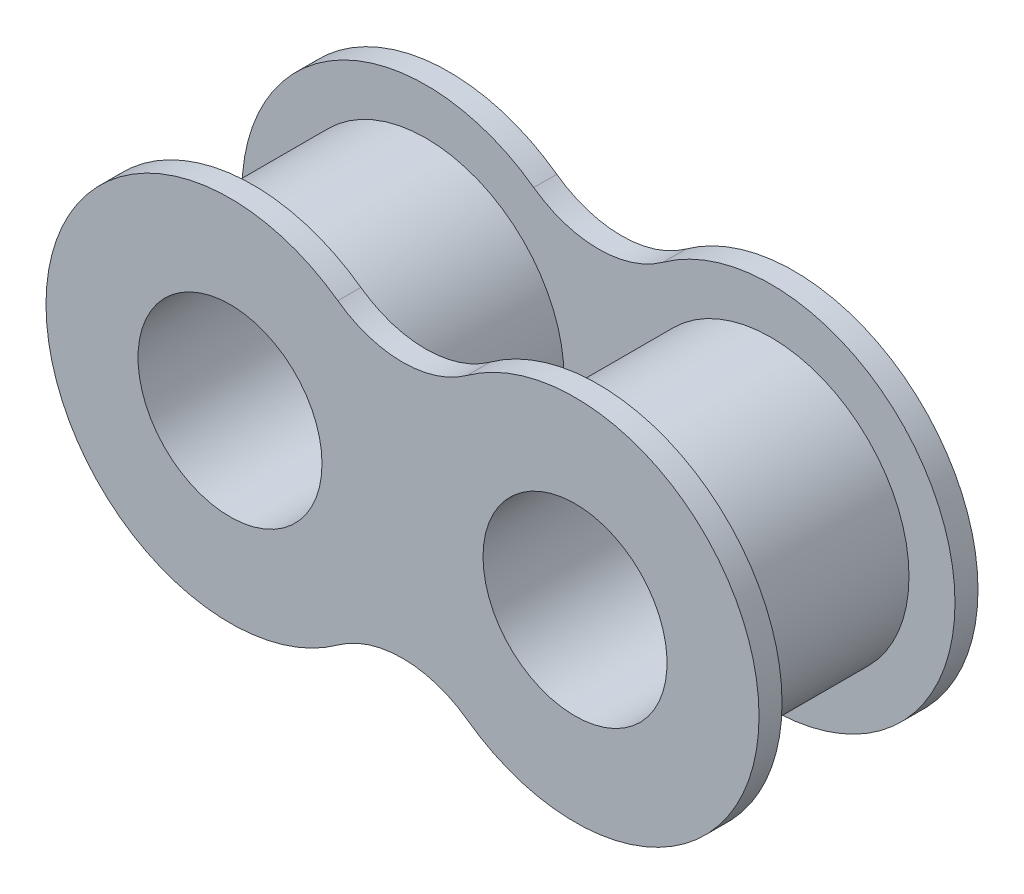
ISO-10303-21;
HEADER;
FILE_DESCRIPTION(('STEP AP214'),'2;1');
FILE_NAME('part.step','',(''),(''),'','','');
FILE_SCHEMA(('AUTOMOTIVE_DESIGN { 1 0 10303 214 1 1 1 1 }'));
ENDSEC;
DATA;
#1=APPLICATION_CONTEXT('core data for automotive mechanical design processes');
#2=APPLICATION_PROTOCOL_DEFINITION('international standard','automotive_design',2000,#1);
#3=PRODUCT_CONTEXT('',#1,'mechanical');
#4=PRODUCT('Part','Part','',(#3));
#5=PRODUCT_RELATED_PRODUCT_CATEGORY('part','',(#4));
#6=PRODUCT_DEFINITION_FORMATION('','',#4);
#7=PRODUCT_DEFINITION_CONTEXT('part definition',#1,'design');
#8=PRODUCT_DEFINITION('design','',#6,#7);
#9=PRODUCT_DEFINITION_SHAPE('','',#8);
#10=(LENGTH_UNIT() NAMED_UNIT(*) SI_UNIT(.MILLI.,.METRE.));
#11=(NAMED_UNIT(*) PLANE_ANGLE_UNIT() SI_UNIT($,.RADIAN.));
#12=(NAMED_UNIT(*) SI_UNIT($,.STERADIAN.) SOLID_ANGLE_UNIT());
#13=UNCERTAINTY_MEASURE_WITH_UNIT(LENGTH_MEASURE(1.E-05),#10,'distance_accuracy_value','');
#14=(GEOMETRIC_REPRESENTATION_CONTEXT(3) GLOBAL_UNCERTAINTY_ASSIGNED_CONTEXT((#13)) GLOBAL_UNIT_ASSIGNED_CONTEXT((#10,
#11,#12)) REPRESENTATION_CONTEXT('',''));
#15=CARTESIAN_POINT('',(0.,0.,0.));
#16=DIRECTION('',(0.,0.,1.));
#17=DIRECTION('',(1.,0.,0.));
#18=AXIS2_PLACEMENT_3D('',#15,#16,#17);
#19=CARTESIAN_POINT('',(2.38125,3.29328778540534,0.635));
#20=DIRECTION('',(0.,0.,1.));
#21=DIRECTION('',(1.,0.,0.));
#22=AXIS2_PLACEMENT_3D('',#19,#20,#21);
#23=PLANE('',#22);
#24=CARTESIAN_POINT('',(4.7625,0.,0.635));
#25=DIRECTION('',(0.,0.,1.));
#26=DIRECTION('',(1.,0.,0.));
#27=AXIS2_PLACEMENT_3D('',#24,#25,#26);
#28=CIRCLE('',#27,3.81);
#29=CARTESIAN_POINT('',(8.5725,0.,0.635));
#30=VERTEX_POINT('',#29);
#31=EDGE_CURVE('E11',#30,#30,#28,.T.);
#32=ORIENTED_EDGE('',*,*,#31,.F.);
#33=EDGE_LOOP('',(#32));
#34=FACE_BOUND('',#33,.T.);
#35=CARTESIAN_POINT('',(0.,6.58657557081068,0.635));
#36=DIRECTION('',(0.,0.,-1.));
#37=DIRECTION('',(1.,0.,0.));
#38=AXIS2_PLACEMENT_3D('',#35,#36,#37);
#39=CIRCLE('',#38,3.048);
#40=CARTESIAN_POINT('',(1.7859375,4.11660973175667,0.635));
#41=VERTEX_POINT('',#40);
#42=CARTESIAN_POINT('',(-1.7859375,4.11660973175667,0.635));
#43=VERTEX_POINT('',#42);
#44=EDGE_CURVE('E169',#41,#43,#39,.T.);
#45=ORIENTED_EDGE('',*,*,#44,.T.);
#46=CARTESIAN_POINT('',(-4.7625,0.,0.635));
#47=DIRECTION('',(0.,0.,1.));
#48=DIRECTION('',(1.,0.,0.));
#49=AXIS2_PLACEMENT_3D('',#46,#47,#48);
#50=CIRCLE('',#49,5.08);
#51=CARTESIAN_POINT('',(-1.7859375,-4.11660973175667,0.635));
#52=VERTEX_POINT('',#51);
#53=EDGE_CURVE('E81',#43,#52,#50,.T.);
#54=ORIENTED_EDGE('',*,*,#53,.T.);
#55=CARTESIAN_POINT('',(0.,-6.58657557081068,0.635));
#56=DIRECTION('',(0.,0.,-1.));
#57=DIRECTION('',(-1.,0.,0.));
#58=AXIS2_PLACEMENT_3D('',#55,#56,#57);
#59=CIRCLE('',#58,3.048);
#60=CARTESIAN_POINT('',(1.7859375,-4.11660973175667,0.635));
#61=VERTEX_POINT('',#60);
#62=EDGE_CURVE('E172',#52,#61,#59,.T.);
#63=ORIENTED_EDGE('',*,*,#62,.T.);
#64=CARTESIAN_POINT('',(4.7625,0.,0.635));
#65=DIRECTION('',(0.,0.,1.));
#66=DIRECTION('',(-1.,0.,0.));
#67=AXIS2_PLACEMENT_3D('',#64,#65,#66);
#68=CIRCLE('',#67,5.08);
#69=EDGE_CURVE('E49',#61,#41,#68,.T.);
#70=ORIENTED_EDGE('',*,*,#69,.T.);
#71=EDGE_LOOP('',(#45,#54,#63,#70));
#72=FACE_BOUND('',#71,.T.);
#73=CARTESIAN_POINT('',(-4.7625,0.,0.635));
#74=DIRECTION('',(0.,0.,1.));
#75=DIRECTION('',(1.,0.,0.));
#76=AXIS2_PLACEMENT_3D('',#73,#74,#75);
#77=CIRCLE('',#76,3.81);
#78=CARTESIAN_POINT('',(-0.952499999999999,0.,0.635));
#79=VERTEX_POINT('',#78);
#80=EDGE_CURVE('E156',#79,#79,#77,.T.);
#81=ORIENTED_EDGE('',*,*,#80,.F.);
#82=EDGE_LOOP('',(#81));
#83=FACE_BOUND('',#82,.T.);
#84=ADVANCED_FACE('F32',(#34,#72,#83),#23,.T.);
#85=CARTESIAN_POINT('',(2.38125,3.29328778540534,0.));
#86=DIRECTION('',(0.,0.,1.));
#87=DIRECTION('',(1.,0.,0.));
#88=AXIS2_PLACEMENT_3D('',#85,#86,#87);
#89=PLANE('',#88);
#90=CARTESIAN_POINT('',(0.,6.58657557081068,0.));
#91=DIRECTION('',(0.,0.,-1.));
#92=DIRECTION('',(1.,0.,0.));
#93=AXIS2_PLACEMENT_3D('',#90,#91,#92);
#94=CIRCLE('',#93,3.048);
#95=CARTESIAN_POINT('',(1.7859375,4.11660973175667,0.));
#96=VERTEX_POINT('',#95);
#97=CARTESIAN_POINT('',(-1.7859375,4.11660973175667,0.));
#98=VERTEX_POINT('',#97);
#99=EDGE_CURVE('E168',#96,#98,#94,.T.);
#100=ORIENTED_EDGE('',*,*,#99,.F.);
#101=CARTESIAN_POINT('',(4.7625,0.,0.));
#102=DIRECTION('',(0.,0.,1.));
#103=DIRECTION('',(-1.,0.,0.));
#104=AXIS2_PLACEMENT_3D('',#101,#102,#103);
#105=CIRCLE('',#104,5.08);
#106=CARTESIAN_POINT('',(1.7859375,-4.11660973175667,0.));
#107=VERTEX_POINT('',#106);
#108=EDGE_CURVE('E73',#107,#96,#105,.T.);
#109=ORIENTED_EDGE('',*,*,#108,.F.);
#110=CARTESIAN_POINT('',(0.,-6.58657557081068,0.));
#111=DIRECTION('',(0.,0.,-1.));
#112=DIRECTION('',(-1.,0.,0.));
#113=AXIS2_PLACEMENT_3D('',#110,#111,#112);
#114=CIRCLE('',#113,3.048);
#115=CARTESIAN_POINT('',(-1.7859375,-4.11660973175667,0.));
#116=VERTEX_POINT('',#115);
#117=EDGE_CURVE('E67',#116,#107,#114,.T.);
#118=ORIENTED_EDGE('',*,*,#117,.F.);
#119=CARTESIAN_POINT('',(-4.7625,0.,0.));
#120=DIRECTION('',(0.,0.,1.));
#121=DIRECTION('',(1.,0.,0.));
#122=AXIS2_PLACEMENT_3D('',#119,#120,#121);
#123=CIRCLE('',#122,5.08);
#124=EDGE_CURVE('E178',#98,#116,#123,.T.);
#125=ORIENTED_EDGE('',*,*,#124,.F.);
#126=EDGE_LOOP('',(#100,#109,#118,#125));
#127=FACE_BOUND('',#126,.T.);
#128=CARTESIAN_POINT('',(-4.7625,0.,0.));
#129=DIRECTION('',(0.,0.,1.));
#130=DIRECTION('',(1.,0.,0.));
#131=AXIS2_PLACEMENT_3D('',#128,#129,#130);
#132=CIRCLE('',#131,2.54);
#133=CARTESIAN_POINT('',(-2.2225,0.,0.));
#134=VERTEX_POINT('',#133);
#135=EDGE_CURVE('E165',#134,#134,#132,.T.);
#136=ORIENTED_EDGE('',*,*,#135,.T.);
#137=EDGE_LOOP('',(#136));
#138=FACE_BOUND('',#137,.T.);
#139=CARTESIAN_POINT('',(4.7625,0.,0.));
#140=DIRECTION('',(0.,0.,1.));
#141=DIRECTION('',(-1.,0.,0.));
#142=AXIS2_PLACEMENT_3D('',#139,#140,#141);
#143=CIRCLE('',#142,2.54);
#144=CARTESIAN_POINT('',(2.2225,0.,0.));
#145=VERTEX_POINT('',#144);
#146=EDGE_CURVE('E160',#145,#145,#143,.T.);
#147=ORIENTED_EDGE('',*,*,#146,.T.);
#148=EDGE_LOOP('',(#147));
#149=FACE_BOUND('',#148,.T.);
#150=ADVANCED_FACE('F192',(#127,#138,#149),#89,.F.);
#151=CARTESIAN_POINT('',(0.,6.58657557081068,0.635));
#152=DIRECTION('',(0.,0.,-1.));
#153=DIRECTION('',(-1.,0.,0.));
#154=AXIS2_PLACEMENT_3D('',#151,#152,#153);
#155=CYLINDRICAL_SURFACE('',#154,3.048);
#156=ORIENTED_EDGE('',*,*,#99,.T.);
#157=DIRECTION('',(0.,0.,-1.));
#158=VECTOR('',#157,1.);
#159=CARTESIAN_POINT('',(-1.7859375,4.11660973175667,0.635));
#160=LINE('',#159,#158);
#161=EDGE_CURVE('E41',#43,#98,#160,.T.);
#162=ORIENTED_EDGE('',*,*,#161,.F.);
#163=ORIENTED_EDGE('',*,*,#44,.F.);
#164=DIRECTION('',(0.,0.,-1.));
#165=VECTOR('',#164,1.);
#166=CARTESIAN_POINT('',(1.7859375,4.11660973175667,0.635));
#167=LINE('',#166,#165);
#168=EDGE_CURVE('E175',#41,#96,#167,.T.);
#169=ORIENTED_EDGE('',*,*,#168,.T.);
#170=EDGE_LOOP('',(#156,#162,#163,#169));
#171=FACE_BOUND('',#170,.T.);
#172=ADVANCED_FACE('F34',(#171),#155,.F.);
#173=CARTESIAN_POINT('',(-4.7625,0.,0.635));
#174=DIRECTION('',(0.,0.,-1.));
#175=DIRECTION('',(-1.,0.,0.));
#176=AXIS2_PLACEMENT_3D('',#173,#174,#175);
#177=CYLINDRICAL_SURFACE('',#176,5.08);
#178=ORIENTED_EDGE('',*,*,#124,.T.);
#179=DIRECTION('',(0.,0.,-1.));
#180=VECTOR('',#179,1.);
#181=CARTESIAN_POINT('',(-1.7859375,-4.11660973175667,0.635));
#182=LINE('',#181,#180);
#183=EDGE_CURVE('E185',#52,#116,#182,.T.);
#184=ORIENTED_EDGE('',*,*,#183,.F.);
#185=ORIENTED_EDGE('',*,*,#53,.F.);
#186=ORIENTED_EDGE('',*,*,#161,.T.);
#187=EDGE_LOOP('',(#178,#184,#185,#186));
#188=FACE_BOUND('',#187,.T.);
#189=ADVANCED_FACE('F187',(#188),#177,.T.);
#190=CARTESIAN_POINT('',(0.,-6.58657557081068,0.635));
#191=DIRECTION('',(0.,0.,-1.));
#192=DIRECTION('',(-1.,0.,0.));
#193=AXIS2_PLACEMENT_3D('',#190,#191,#192);
#194=CYLINDRICAL_SURFACE('',#193,3.048);
#195=ORIENTED_EDGE('',*,*,#117,.T.);
#196=DIRECTION('',(0.,0.,-1.));
#197=VECTOR('',#196,1.);
#198=CARTESIAN_POINT('',(1.7859375,-4.11660973175667,0.635));
#199=LINE('',#198,#197);
#200=EDGE_CURVE('E183',#61,#107,#199,.T.);
#201=ORIENTED_EDGE('',*,*,#200,.F.);
#202=ORIENTED_EDGE('',*,*,#62,.F.);
#203=ORIENTED_EDGE('',*,*,#183,.T.);
#204=EDGE_LOOP('',(#195,#201,#202,#203));
#205=FACE_BOUND('',#204,.T.);
#206=ADVANCED_FACE('F244',(#205),#194,.F.);
#207=CARTESIAN_POINT('',(4.7625,0.,0.635));
#208=DIRECTION('',(0.,0.,-1.));
#209=DIRECTION('',(-1.,0.,0.));
#210=AXIS2_PLACEMENT_3D('',#207,#208,#209);
#211=CYLINDRICAL_SURFACE('',#210,5.08);
#212=ORIENTED_EDGE('',*,*,#108,.T.);
#213=ORIENTED_EDGE('',*,*,#168,.F.);
#214=ORIENTED_EDGE('',*,*,#69,.F.);
#215=ORIENTED_EDGE('',*,*,#200,.T.);
#216=EDGE_LOOP('',(#212,#213,#214,#215));
#217=FACE_BOUND('',#216,.T.);
#218=ADVANCED_FACE('F241',(#217),#211,.T.);
#219=CARTESIAN_POINT('',(-4.7625,0.,0.635));
#220=DIRECTION('',(0.,0.,-1.));
#221=DIRECTION('',(-1.,0.,0.));
#222=AXIS2_PLACEMENT_3D('',#219,#220,#221);
#223=CYLINDRICAL_SURFACE('',#222,2.54);
#224=ORIENTED_EDGE('',*,*,#135,.F.);
#225=EDGE_LOOP('',(#224));
#226=FACE_BOUND('',#225,.T.);
#227=CARTESIAN_POINT('',(-4.7625,0.,6.0452));
#228=DIRECTION('',(0.,0.,1.));
#229=DIRECTION('',(1.,0.,0.));
#230=AXIS2_PLACEMENT_3D('',#227,#228,#229);
#231=CIRCLE('',#230,2.54);
#232=CARTESIAN_POINT('',(-2.2225,0.,6.0452));
#233=VERTEX_POINT('',#232);
#234=EDGE_CURVE('E143',#233,#233,#231,.T.);
#235=ORIENTED_EDGE('',*,*,#234,.T.);
#236=EDGE_LOOP('',(#235));
#237=FACE_BOUND('',#236,.T.);
#238=ADVANCED_FACE('F204',(#226,#237),#223,.F.);
#239=CARTESIAN_POINT('',(4.7625,0.,0.635));
#240=DIRECTION('',(0.,0.,-1.));
#241=DIRECTION('',(-1.,0.,0.));
#242=AXIS2_PLACEMENT_3D('',#239,#240,#241);
#243=CYLINDRICAL_SURFACE('',#242,2.54);
#244=ORIENTED_EDGE('',*,*,#146,.F.);
#245=EDGE_LOOP('',(#244));
#246=FACE_BOUND('',#245,.T.);
#247=CARTESIAN_POINT('',(4.7625,0.,6.0452));
#248=DIRECTION('',(0.,0.,1.));
#249=DIRECTION('',(-1.,0.,0.));
#250=AXIS2_PLACEMENT_3D('',#247,#248,#249);
#251=CIRCLE('',#250,2.54);
#252=CARTESIAN_POINT('',(2.2225,0.,6.0452));
#253=VERTEX_POINT('',#252);
#254=EDGE_CURVE('E208',#253,#253,#251,.T.);
#255=ORIENTED_EDGE('',*,*,#254,.T.);
#256=EDGE_LOOP('',(#255));
#257=FACE_BOUND('',#256,.T.);
#258=ADVANCED_FACE('F200',(#246,#257),#243,.F.);
#259=CARTESIAN_POINT('',(-4.7625,0.,5.4102));
#260=DIRECTION('',(0.,0.,-1.));
#261=DIRECTION('',(-1.,0.,0.));
#262=AXIS2_PLACEMENT_3D('',#259,#260,#261);
#263=CYLINDRICAL_SURFACE('',#262,3.81);
#264=CARTESIAN_POINT('',(-4.7625,0.,5.4102));
#265=DIRECTION('',(0.,0.,1.));
#266=DIRECTION('',(1.,0.,0.));
#267=AXIS2_PLACEMENT_3D('',#264,#265,#266);
#268=CIRCLE('',#267,3.81);
#269=CARTESIAN_POINT('',(-0.952499999999999,0.,5.4102));
#270=VERTEX_POINT('',#269);
#271=EDGE_CURVE('E157',#270,#270,#268,.T.);
#272=ORIENTED_EDGE('',*,*,#271,.F.);
#273=EDGE_LOOP('',(#272));
#274=FACE_BOUND('',#273,.T.);
#275=ORIENTED_EDGE('',*,*,#80,.T.);
#276=EDGE_LOOP('',(#275));
#277=FACE_BOUND('',#276,.T.);
#278=ADVANCED_FACE('F203',(#274,#277),#263,.T.);
#279=CARTESIAN_POINT('',(4.7625,0.,5.4102));
#280=DIRECTION('',(0.,0.,-1.));
#281=DIRECTION('',(-1.,0.,0.));
#282=AXIS2_PLACEMENT_3D('',#279,#280,#281);
#283=CYLINDRICAL_SURFACE('',#282,3.81);
#284=CARTESIAN_POINT('',(4.7625,0.,5.4102));
#285=DIRECTION('',(0.,0.,-1.));
#286=DIRECTION('',(-1.,0.,0.));
#287=AXIS2_PLACEMENT_3D('',#284,#285,#286);
#288=CIRCLE('',#287,3.81);
#289=CARTESIAN_POINT('',(0.952499999999999,0.,5.4102));
#290=VERTEX_POINT('',#289);
#291=EDGE_CURVE('E119',#290,#290,#288,.T.);
#292=ORIENTED_EDGE('',*,*,#291,.T.);
#293=EDGE_LOOP('',(#292));
#294=FACE_BOUND('',#293,.T.);
#295=ORIENTED_EDGE('',*,*,#31,.T.);
#296=EDGE_LOOP('',(#295));
#297=FACE_BOUND('',#296,.T.);
#298=ADVANCED_FACE('F302',(#294,#297),#283,.T.);
#299=CARTESIAN_POINT('',(2.38125,3.29328778540534,5.4102));
#300=DIRECTION('',(0.,0.,-1.));
#301=DIRECTION('',(1.,0.,0.));
#302=AXIS2_PLACEMENT_3D('',#299,#300,#301);
#303=PLANE('',#302);
#304=CARTESIAN_POINT('',(0.,6.58657557081068,5.4102));
#305=DIRECTION('',(0.,0.,-1.));
#306=DIRECTION('',(1.,0.,0.));
#307=AXIS2_PLACEMENT_3D('',#304,#305,#306);
#308=CIRCLE('',#307,3.048);
#309=CARTESIAN_POINT('',(1.7859375,4.11660973175667,5.4102));
#310=VERTEX_POINT('',#309);
#311=CARTESIAN_POINT('',(-1.7859375,4.11660973175667,5.4102));
#312=VERTEX_POINT('',#311);
#313=EDGE_CURVE('E111',#310,#312,#308,.T.);
#314=ORIENTED_EDGE('',*,*,#313,.F.);
#315=CARTESIAN_POINT('',(4.7625,0.,5.4102));
#316=DIRECTION('',(0.,0.,1.));
#317=DIRECTION('',(-1.,0.,0.));
#318=AXIS2_PLACEMENT_3D('',#315,#316,#317);
#319=CIRCLE('',#318,5.08);
#320=CARTESIAN_POINT('',(1.7859375,-4.11660973175667,5.4102));
#321=VERTEX_POINT('',#320);
#322=EDGE_CURVE('E127',#321,#310,#319,.T.);
#323=ORIENTED_EDGE('',*,*,#322,.F.);
#324=CARTESIAN_POINT('',(0.,-6.58657557081068,5.4102));
#325=DIRECTION('',(0.,0.,-1.));
#326=DIRECTION('',(-1.,0.,0.));
#327=AXIS2_PLACEMENT_3D('',#324,#325,#326);
#328=CIRCLE('',#327,3.048);
#329=CARTESIAN_POINT('',(-1.7859375,-4.11660973175667,5.4102));
#330=VERTEX_POINT('',#329);
#331=EDGE_CURVE('E134',#330,#321,#328,.T.);
#332=ORIENTED_EDGE('',*,*,#331,.F.);
#333=CARTESIAN_POINT('',(-4.7625,0.,5.4102));
#334=DIRECTION('',(0.,0.,1.));
#335=DIRECTION('',(1.,0.,0.));
#336=AXIS2_PLACEMENT_3D('',#333,#334,#335);
#337=CIRCLE('',#336,5.08);
#338=EDGE_CURVE('E130',#312,#330,#337,.T.);
#339=ORIENTED_EDGE('',*,*,#338,.F.);
#340=EDGE_LOOP('',(#314,#323,#332,#339));
#341=FACE_BOUND('',#340,.T.);
#342=ORIENTED_EDGE('',*,*,#291,.F.);
#343=EDGE_LOOP('',(#342));
#344=FACE_BOUND('',#343,.T.);
#345=ORIENTED_EDGE('',*,*,#271,.T.);
#346=EDGE_LOOP('',(#345));
#347=FACE_BOUND('',#346,.T.);
#348=ADVANCED_FACE('F124',(#341,#344,#347),#303,.T.);
#349=CARTESIAN_POINT('',(0.,6.58657557081068,5.4102));
#350=DIRECTION('',(0.,0.,1.));
#351=DIRECTION('',(1.,0.,0.));
#352=AXIS2_PLACEMENT_3D('',#349,#350,#351);
#353=CYLINDRICAL_SURFACE('',#352,3.048);
#354=CARTESIAN_POINT('',(0.,6.58657557081068,6.0452));
#355=DIRECTION('',(0.,0.,-1.));
#356=DIRECTION('',(1.,0.,0.));
#357=AXIS2_PLACEMENT_3D('',#354,#355,#356);
#358=CIRCLE('',#357,3.048);
#359=CARTESIAN_POINT('',(1.7859375,4.11660973175667,6.0452));
#360=VERTEX_POINT('',#359);
#361=CARTESIAN_POINT('',(-1.7859375,4.11660973175667,6.0452));
#362=VERTEX_POINT('',#361);
#363=EDGE_CURVE('E114',#360,#362,#358,.T.);
#364=ORIENTED_EDGE('',*,*,#363,.F.);
#365=DIRECTION('',(0.,0.,1.));
#366=VECTOR('',#365,1.);
#367=CARTESIAN_POINT('',(1.7859375,4.11660973175667,5.4102));
#368=LINE('',#367,#366);
#369=EDGE_CURVE('E108',#310,#360,#368,.T.);
#370=ORIENTED_EDGE('',*,*,#369,.F.);
#371=ORIENTED_EDGE('',*,*,#313,.T.);
#372=DIRECTION('',(0.,0.,1.));
#373=VECTOR('',#372,1.);
#374=CARTESIAN_POINT('',(-1.7859375,4.11660973175667,5.4102));
#375=LINE('',#374,#373);
#376=EDGE_CURVE('E140',#312,#362,#375,.T.);
#377=ORIENTED_EDGE('',*,*,#376,.T.);
#378=EDGE_LOOP('',(#364,#370,#371,#377));
#379=FACE_BOUND('',#378,.T.);
#380=ADVANCED_FACE('F110',(#379),#353,.F.);
#381=CARTESIAN_POINT('',(4.7625,0.,5.4102));
#382=DIRECTION('',(0.,0.,1.));
#383=DIRECTION('',(1.,0.,0.));
#384=AXIS2_PLACEMENT_3D('',#381,#382,#383);
#385=CYLINDRICAL_SURFACE('',#384,5.08);
#386=CARTESIAN_POINT('',(4.7625,0.,6.0452));
#387=DIRECTION('',(0.,0.,1.));
#388=DIRECTION('',(-1.,0.,0.));
#389=AXIS2_PLACEMENT_3D('',#386,#387,#388);
#390=CIRCLE('',#389,5.08);
#391=CARTESIAN_POINT('',(1.7859375,-4.11660973175667,6.0452));
#392=VERTEX_POINT('',#391);
#393=EDGE_CURVE('E142',#392,#360,#390,.T.);
#394=ORIENTED_EDGE('',*,*,#393,.F.);
#395=DIRECTION('',(0.,0.,1.));
#396=VECTOR('',#395,1.);
#397=CARTESIAN_POINT('',(1.7859375,-4.11660973175667,5.4102));
#398=LINE('',#397,#396);
#399=EDGE_CURVE('E120',#321,#392,#398,.T.);
#400=ORIENTED_EDGE('',*,*,#399,.F.);
#401=ORIENTED_EDGE('',*,*,#322,.T.);
#402=ORIENTED_EDGE('',*,*,#369,.T.);
#403=EDGE_LOOP('',(#394,#400,#401,#402));
#404=FACE_BOUND('',#403,.T.);
#405=ADVANCED_FACE('F133',(#404),#385,.T.);
#406=CARTESIAN_POINT('',(0.,-6.58657557081068,5.4102));
#407=DIRECTION('',(0.,0.,1.));
#408=DIRECTION('',(1.,0.,0.));
#409=AXIS2_PLACEMENT_3D('',#406,#407,#408);
#410=CYLINDRICAL_SURFACE('',#409,3.048);
#411=CARTESIAN_POINT('',(0.,-6.58657557081068,6.0452));
#412=DIRECTION('',(0.,0.,-1.));
#413=DIRECTION('',(-1.,0.,0.));
#414=AXIS2_PLACEMENT_3D('',#411,#412,#413);
#415=CIRCLE('',#414,3.048);
#416=CARTESIAN_POINT('',(-1.7859375,-4.11660973175667,6.0452));
#417=VERTEX_POINT('',#416);
#418=EDGE_CURVE('E145',#417,#392,#415,.T.);
#419=ORIENTED_EDGE('',*,*,#418,.F.);
#420=DIRECTION('',(0.,0.,1.));
#421=VECTOR('',#420,1.);
#422=CARTESIAN_POINT('',(-1.7859375,-4.11660973175667,5.4102));
#423=LINE('',#422,#421);
#424=EDGE_CURVE('E151',#330,#417,#423,.T.);
#425=ORIENTED_EDGE('',*,*,#424,.F.);
#426=ORIENTED_EDGE('',*,*,#331,.T.);
#427=ORIENTED_EDGE('',*,*,#399,.T.);
#428=EDGE_LOOP('',(#419,#425,#426,#427));
#429=FACE_BOUND('',#428,.T.);
#430=ADVANCED_FACE('F224',(#429),#410,.F.);
#431=CARTESIAN_POINT('',(-4.7625,0.,5.4102));
#432=DIRECTION('',(0.,0.,1.));
#433=DIRECTION('',(1.,0.,0.));
#434=AXIS2_PLACEMENT_3D('',#431,#432,#433);
#435=CYLINDRICAL_SURFACE('',#434,5.08);
#436=CARTESIAN_POINT('',(-4.7625,0.,6.0452));
#437=DIRECTION('',(0.,0.,1.));
#438=DIRECTION('',(1.,0.,0.));
#439=AXIS2_PLACEMENT_3D('',#436,#437,#438);
#440=CIRCLE('',#439,5.08);
#441=EDGE_CURVE('E131',#362,#417,#440,.T.);
#442=ORIENTED_EDGE('',*,*,#441,.F.);
#443=ORIENTED_EDGE('',*,*,#376,.F.);
#444=ORIENTED_EDGE('',*,*,#338,.T.);
#445=ORIENTED_EDGE('',*,*,#424,.T.);
#446=EDGE_LOOP('',(#442,#443,#444,#445));
#447=FACE_BOUND('',#446,.T.);
#448=ADVANCED_FACE('F218',(#447),#435,.T.);
#449=CARTESIAN_POINT('',(2.38125,3.29328778540534,6.0452));
#450=DIRECTION('',(0.,0.,-1.));
#451=DIRECTION('',(1.,0.,0.));
#452=AXIS2_PLACEMENT_3D('',#449,#450,#451);
#453=PLANE('',#452);
#454=ORIENTED_EDGE('',*,*,#254,.F.);
#455=EDGE_LOOP('',(#454));
#456=FACE_BOUND('',#455,.T.);
#457=ORIENTED_EDGE('',*,*,#234,.F.);
#458=EDGE_LOOP('',(#457));
#459=FACE_BOUND('',#458,.T.);
#460=ORIENTED_EDGE('',*,*,#363,.T.);
#461=ORIENTED_EDGE('',*,*,#441,.T.);
#462=ORIENTED_EDGE('',*,*,#418,.T.);
#463=ORIENTED_EDGE('',*,*,#393,.T.);
#464=EDGE_LOOP('',(#460,#461,#462,#463));
#465=FACE_BOUND('',#464,.T.);
#466=ADVANCED_FACE('F215',(#456,#459,#465),#453,.F.);
#467=CLOSED_SHELL('',(#84,#150,#172,#189,#206,#218,#238,#258,#278,#298,#348,#380,#405,#430,#448,#466));
#468=MANIFOLD_SOLID_BREP('B2',#467);
#469=ADVANCED_BREP_SHAPE_REPRESENTATION('',(#18,#468),#14);
#470=SHAPE_DEFINITION_REPRESENTATION(#9,#469);
ENDSEC;
END-ISO-10303-21;
